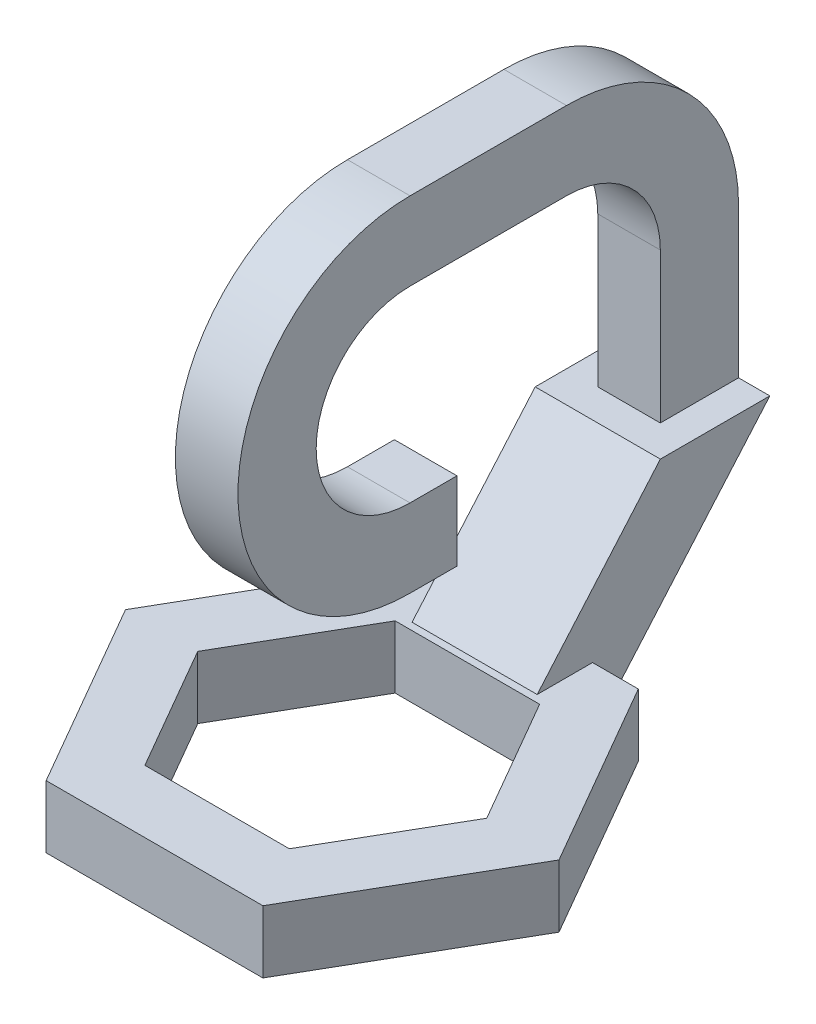
ISO-10303-21;
HEADER;
FILE_DESCRIPTION(('STEP AP214'),'2;1');
FILE_NAME('part.step','',(''),(''),'','','');
FILE_SCHEMA(('AUTOMOTIVE_DESIGN { 1 0 10303 214 1 1 1 1 }'));
ENDSEC;
DATA;
#1=APPLICATION_CONTEXT('core data for automotive mechanical design processes');
#2=APPLICATION_PROTOCOL_DEFINITION('international standard','automotive_design',2000,#1);
#3=PRODUCT_CONTEXT('',#1,'mechanical');
#4=PRODUCT('Part','Part','',(#3));
#5=PRODUCT_RELATED_PRODUCT_CATEGORY('part','',(#4));
#6=PRODUCT_DEFINITION_FORMATION('','',#4);
#7=PRODUCT_DEFINITION_CONTEXT('part definition',#1,'design');
#8=PRODUCT_DEFINITION('design','',#6,#7);
#9=PRODUCT_DEFINITION_SHAPE('','',#8);
#10=(LENGTH_UNIT() NAMED_UNIT(*) SI_UNIT(.MILLI.,.METRE.));
#11=(NAMED_UNIT(*) PLANE_ANGLE_UNIT() SI_UNIT($,.RADIAN.));
#12=(NAMED_UNIT(*) SI_UNIT($,.STERADIAN.) SOLID_ANGLE_UNIT());
#13=UNCERTAINTY_MEASURE_WITH_UNIT(LENGTH_MEASURE(1.E-05),#10,'distance_accuracy_value','');
#14=(GEOMETRIC_REPRESENTATION_CONTEXT(3) GLOBAL_UNCERTAINTY_ASSIGNED_CONTEXT((#13)) GLOBAL_UNIT_ASSIGNED_CONTEXT((#10,
#11,#12)) REPRESENTATION_CONTEXT('',''));
#15=CARTESIAN_POINT('',(0.,0.,0.));
#16=DIRECTION('',(0.,0.,1.));
#17=DIRECTION('',(1.,0.,0.));
#18=AXIS2_PLACEMENT_3D('',#15,#16,#17);
#19=CARTESIAN_POINT('',(80.,261.9,-466.675639388668));
#20=DIRECTION('',(0.,-1.,0.));
#21=DIRECTION('',(0.,0.,-1.));
#22=AXIS2_PLACEMENT_3D('',#19,#20,#21);
#23=PLANE('',#22);
#24=DIRECTION('',(0.,0.,-1.));
#25=VECTOR('',#24,1.);
#26=CARTESIAN_POINT('',(40.,261.9,-366.675639388668));
#27=LINE('',#26,#25);
#28=CARTESIAN_POINT('',(40.,261.9,-366.675639388668));
#29=VERTEX_POINT('',#28);
#30=CARTESIAN_POINT('',(40.,261.9,-466.675639388668));
#31=VERTEX_POINT('',#30);
#32=EDGE_CURVE('E419',#29,#31,#27,.T.);
#33=ORIENTED_EDGE('',*,*,#32,.F.);
#34=DIRECTION('',(-1.,0.,0.));
#35=VECTOR('',#34,1.);
#36=CARTESIAN_POINT('',(40.,261.9,-366.675639388668));
#37=LINE('',#36,#35);
#38=CARTESIAN_POINT('',(-40.,261.9,-366.675639388668));
#39=VERTEX_POINT('',#38);
#40=EDGE_CURVE('E415',#29,#39,#37,.T.);
#41=ORIENTED_EDGE('',*,*,#40,.T.);
#42=DIRECTION('',(0.,0.,-1.));
#43=VECTOR('',#42,1.);
#44=CARTESIAN_POINT('',(-40.,261.9,-366.675639388668));
#45=LINE('',#44,#43);
#46=CARTESIAN_POINT('',(-40.,261.9,-466.675639388668));
#47=VERTEX_POINT('',#46);
#48=EDGE_CURVE('E447',#39,#47,#45,.T.);
#49=ORIENTED_EDGE('',*,*,#48,.T.);
#50=DIRECTION('',(-1.,0.,0.));
#51=VECTOR('',#50,1.);
#52=CARTESIAN_POINT('',(80.,261.9,-466.675639388668));
#53=LINE('',#52,#51);
#54=CARTESIAN_POINT('',(-80.,261.9,-466.675639388668));
#55=VERTEX_POINT('',#54);
#56=EDGE_CURVE('E275',#47,#55,#53,.T.);
#57=ORIENTED_EDGE('',*,*,#56,.T.);
#58=DIRECTION('',(0.,0.,1.));
#59=VECTOR('',#58,1.);
#60=CARTESIAN_POINT('',(-80.,261.9,-466.675639388668));
#61=LINE('',#60,#59);
#62=CARTESIAN_POINT('',(-80.,261.9,-326.675639388668));
#63=VERTEX_POINT('',#62);
#64=EDGE_CURVE('E253',#55,#63,#61,.T.);
#65=ORIENTED_EDGE('',*,*,#64,.T.);
#66=DIRECTION('',(-1.,0.,0.));
#67=VECTOR('',#66,1.);
#68=CARTESIAN_POINT('',(80.,261.9,-326.675639388668));
#69=LINE('',#68,#67);
#70=CARTESIAN_POINT('',(80.,261.9,-326.675639388668));
#71=VERTEX_POINT('',#70);
#72=EDGE_CURVE('E272',#71,#63,#69,.T.);
#73=ORIENTED_EDGE('',*,*,#72,.F.);
#74=DIRECTION('',(0.,0.,1.));
#75=VECTOR('',#74,1.);
#76=CARTESIAN_POINT('',(80.,261.9,-466.675639388668));
#77=LINE('',#76,#75);
#78=CARTESIAN_POINT('',(80.,261.9,-466.675639388668));
#79=VERTEX_POINT('',#78);
#80=EDGE_CURVE('E261',#79,#71,#77,.T.);
#81=ORIENTED_EDGE('',*,*,#80,.F.);
#82=EDGE_CURVE('E276',#79,#31,#53,.T.);
#83=ORIENTED_EDGE('',*,*,#82,.T.);
#84=EDGE_LOOP('',(#33,#41,#49,#57,#65,#73,#81,#83));
#85=FACE_BOUND('',#84,.T.);
#86=ADVANCED_FACE('F35',(#85),#23,.F.);
#87=CARTESIAN_POINT('',(0.,80.,0.));
#88=DIRECTION('',(0.,1.,0.));
#89=DIRECTION('',(0.,0.,1.));
#90=AXIS2_PLACEMENT_3D('',#87,#88,#89);
#91=PLANE('',#90);
#92=DIRECTION('',(-0.5,0.,0.866025403784438));
#93=VECTOR('',#92,1.);
#94=CARTESIAN_POINT('',(-92.3619784648299,80.,-159.975639388668));
#95=LINE('',#94,#93);
#96=CARTESIAN_POINT('',(-92.3619784648299,80.,-159.975639388668));
#97=VERTEX_POINT('',#96);
#98=CARTESIAN_POINT('',(-184.72395692966,80.,0.));
#99=VERTEX_POINT('',#98);
#100=EDGE_CURVE('E288',#97,#99,#95,.T.);
#101=ORIENTED_EDGE('',*,*,#100,.F.);
#102=DIRECTION('',(-1.,0.,0.));
#103=VECTOR('',#102,1.);
#104=CARTESIAN_POINT('',(92.3619784648298,80.,-159.975639388668));
#105=LINE('',#104,#103);
#106=CARTESIAN_POINT('',(92.3619784648298,80.,-159.975639388668));
#107=VERTEX_POINT('',#106);
#108=EDGE_CURVE('E286',#107,#97,#105,.T.);
#109=ORIENTED_EDGE('',*,*,#108,.F.);
#110=DIRECTION('',(-0.5,0.,-0.866025403784438));
#111=VECTOR('',#110,1.);
#112=CARTESIAN_POINT('',(184.72395692966,80.,0.));
#113=LINE('',#112,#111);
#114=CARTESIAN_POINT('',(184.72395692966,80.,0.));
#115=VERTEX_POINT('',#114);
#116=EDGE_CURVE('E298',#115,#107,#113,.T.);
#117=ORIENTED_EDGE('',*,*,#116,.F.);
#118=DIRECTION('',(0.5,0.,-0.866025403784439));
#119=VECTOR('',#118,1.);
#120=CARTESIAN_POINT('',(92.3619784648299,80.,159.975639388668));
#121=LINE('',#120,#119);
#122=CARTESIAN_POINT('',(92.3619784648299,80.,159.975639388668));
#123=VERTEX_POINT('',#122);
#124=EDGE_CURVE('E295',#123,#115,#121,.T.);
#125=ORIENTED_EDGE('',*,*,#124,.F.);
#126=DIRECTION('',(1.,0.,0.));
#127=VECTOR('',#126,1.);
#128=CARTESIAN_POINT('',(-92.36197846483,80.,159.975639388668));
#129=LINE('',#128,#127);
#130=CARTESIAN_POINT('',(-92.36197846483,80.,159.975639388668));
#131=VERTEX_POINT('',#130);
#132=EDGE_CURVE('E293',#131,#123,#129,.T.);
#133=ORIENTED_EDGE('',*,*,#132,.F.);
#134=DIRECTION('',(0.5,0.,0.866025403784439));
#135=VECTOR('',#134,1.);
#136=CARTESIAN_POINT('',(-184.72395692966,80.,0.));
#137=LINE('',#136,#135);
#138=EDGE_CURVE('E291',#99,#131,#137,.T.);
#139=ORIENTED_EDGE('',*,*,#138,.F.);
#140=EDGE_LOOP('',(#101,#109,#117,#125,#133,#139));
#141=FACE_BOUND('',#140,.T.);
#142=DIRECTION('',(-1.,0.,0.));
#143=VECTOR('',#142,1.);
#144=CARTESIAN_POINT('',(138.55,80.,-239.975639388668));
#145=LINE('',#144,#143);
#146=CARTESIAN_POINT('',(138.55,80.,-239.975639388668));
#147=VERTEX_POINT('',#146);
#148=CARTESIAN_POINT('',(80.,80.,-239.975639388668));
#149=VERTEX_POINT('',#148);
#150=EDGE_CURVE('E331',#147,#149,#145,.T.);
#151=ORIENTED_EDGE('',*,*,#150,.T.);
#152=DIRECTION('',(0.,0.,1.));
#153=VECTOR('',#152,1.);
#154=CARTESIAN_POINT('',(80.,80.,0.));
#155=LINE('',#154,#153);
#156=CARTESIAN_POINT('',(80.,80.,-169.223443894204));
#157=VERTEX_POINT('',#156);
#158=EDGE_CURVE('E282',#149,#157,#155,.T.);
#159=ORIENTED_EDGE('',*,*,#158,.T.);
#160=DIRECTION('',(-1.,0.,0.));
#161=VECTOR('',#160,1.);
#162=CARTESIAN_POINT('',(80.,80.,-169.223443894204));
#163=LINE('',#162,#161);
#164=CARTESIAN_POINT('',(-80.,80.,-169.223443894204));
#165=VERTEX_POINT('',#164);
#166=EDGE_CURVE('E265',#157,#165,#163,.T.);
#167=ORIENTED_EDGE('',*,*,#166,.T.);
#168=DIRECTION('',(0.,0.,1.));
#169=VECTOR('',#168,1.);
#170=CARTESIAN_POINT('',(-80.,80.,0.));
#171=LINE('',#170,#169);
#172=CARTESIAN_POINT('',(-80.,80.,-239.975639388668));
#173=VERTEX_POINT('',#172);
#174=EDGE_CURVE('E280',#173,#165,#171,.T.);
#175=ORIENTED_EDGE('',*,*,#174,.F.);
#176=CARTESIAN_POINT('',(-138.55,80.,-239.975639388668));
#177=VERTEX_POINT('',#176);
#178=EDGE_CURVE('E335',#173,#177,#145,.T.);
#179=ORIENTED_EDGE('',*,*,#178,.T.);
#180=DIRECTION('',(-0.5,0.,0.866025403784438));
#181=VECTOR('',#180,1.);
#182=CARTESIAN_POINT('',(-138.55,80.,-239.975639388668));
#183=LINE('',#182,#181);
#184=CARTESIAN_POINT('',(-277.1,80.,0.));
#185=VERTEX_POINT('',#184);
#186=EDGE_CURVE('E334',#177,#185,#183,.T.);
#187=ORIENTED_EDGE('',*,*,#186,.T.);
#188=DIRECTION('',(0.5,0.,0.866025403784439));
#189=VECTOR('',#188,1.);
#190=CARTESIAN_POINT('',(-277.1,80.,0.));
#191=LINE('',#190,#189);
#192=CARTESIAN_POINT('',(-138.55,80.,239.975639388668));
#193=VERTEX_POINT('',#192);
#194=EDGE_CURVE('E337',#185,#193,#191,.T.);
#195=ORIENTED_EDGE('',*,*,#194,.T.);
#196=DIRECTION('',(1.,0.,0.));
#197=VECTOR('',#196,1.);
#198=CARTESIAN_POINT('',(-138.55,80.,239.975639388668));
#199=LINE('',#198,#197);
#200=CARTESIAN_POINT('',(138.55,80.,239.975639388668));
#201=VERTEX_POINT('',#200);
#202=EDGE_CURVE('E339',#193,#201,#199,.T.);
#203=ORIENTED_EDGE('',*,*,#202,.T.);
#204=DIRECTION('',(0.5,0.,-0.866025403784439));
#205=VECTOR('',#204,1.);
#206=CARTESIAN_POINT('',(138.55,80.,239.975639388668));
#207=LINE('',#206,#205);
#208=CARTESIAN_POINT('',(277.1,80.,0.));
#209=VERTEX_POINT('',#208);
#210=EDGE_CURVE('E341',#201,#209,#207,.T.);
#211=ORIENTED_EDGE('',*,*,#210,.T.);
#212=DIRECTION('',(-0.5,0.,-0.866025403784438));
#213=VECTOR('',#212,1.);
#214=CARTESIAN_POINT('',(277.1,80.,0.));
#215=LINE('',#214,#213);
#216=EDGE_CURVE('E343',#209,#147,#215,.T.);
#217=ORIENTED_EDGE('',*,*,#216,.T.);
#218=EDGE_LOOP('',(#151,#159,#167,#175,#179,#187,#195,#203,#211,#217));
#219=FACE_BOUND('',#218,.T.);
#220=ADVANCED_FACE('F395',(#141,#219),#91,.T.);
#221=CARTESIAN_POINT('',(138.55,80.,-239.975639388668));
#222=DIRECTION('',(0.,0.,1.));
#223=DIRECTION('',(1.,0.,0.));
#224=AXIS2_PLACEMENT_3D('',#221,#222,#223);
#225=PLANE('',#224);
#226=DIRECTION('',(0.,-1.,0.));
#227=VECTOR('',#226,1.);
#228=CARTESIAN_POINT('',(80.,80.,-239.975639388668));
#229=LINE('',#228,#227);
#230=CARTESIAN_POINT('',(80.,0.,-239.975639388668));
#231=VERTEX_POINT('',#230);
#232=EDGE_CURVE('E11',#149,#231,#229,.T.);
#233=ORIENTED_EDGE('',*,*,#232,.F.);
#234=ORIENTED_EDGE('',*,*,#150,.F.);
#235=DIRECTION('',(0.,-1.,0.));
#236=VECTOR('',#235,1.);
#237=CARTESIAN_POINT('',(138.55,80.,-239.975639388668));
#238=LINE('',#237,#236);
#239=CARTESIAN_POINT('',(138.55,0.,-239.975639388668));
#240=VERTEX_POINT('',#239);
#241=EDGE_CURVE('E345',#147,#240,#238,.T.);
#242=ORIENTED_EDGE('',*,*,#241,.T.);
#243=DIRECTION('',(-1.,0.,0.));
#244=VECTOR('',#243,1.);
#245=CARTESIAN_POINT('',(138.55,0.,-239.975639388668));
#246=LINE('',#245,#244);
#247=EDGE_CURVE('E346',#240,#231,#246,.T.);
#248=ORIENTED_EDGE('',*,*,#247,.T.);
#249=EDGE_LOOP('',(#233,#234,#242,#248));
#250=FACE_BOUND('',#249,.T.);
#251=ADVANCED_FACE('F531',(#250),#225,.F.);
#252=CARTESIAN_POINT('',(0.,0.,0.));
#253=DIRECTION('',(0.,1.,0.));
#254=DIRECTION('',(0.,0.,1.));
#255=AXIS2_PLACEMENT_3D('',#252,#253,#254);
#256=PLANE('',#255);
#257=DIRECTION('',(-1.,0.,0.));
#258=VECTOR('',#257,1.);
#259=CARTESIAN_POINT('',(80.,0.,-239.975639388668));
#260=LINE('',#259,#258);
#261=CARTESIAN_POINT('',(-80.,0.,-239.975639388668));
#262=VERTEX_POINT('',#261);
#263=EDGE_CURVE('E58',#231,#262,#260,.T.);
#264=ORIENTED_EDGE('',*,*,#263,.F.);
#265=ORIENTED_EDGE('',*,*,#247,.F.);
#266=DIRECTION('',(-0.5,0.,-0.866025403784438));
#267=VECTOR('',#266,1.);
#268=CARTESIAN_POINT('',(277.1,0.,0.));
#269=LINE('',#268,#267);
#270=CARTESIAN_POINT('',(277.1,0.,0.));
#271=VERTEX_POINT('',#270);
#272=EDGE_CURVE('E357',#271,#240,#269,.T.);
#273=ORIENTED_EDGE('',*,*,#272,.F.);
#274=DIRECTION('',(0.5,0.,-0.866025403784439));
#275=VECTOR('',#274,1.);
#276=CARTESIAN_POINT('',(138.55,0.,239.975639388668));
#277=LINE('',#276,#275);
#278=CARTESIAN_POINT('',(138.55,0.,239.975639388668));
#279=VERTEX_POINT('',#278);
#280=EDGE_CURVE('E355',#279,#271,#277,.T.);
#281=ORIENTED_EDGE('',*,*,#280,.F.);
#282=DIRECTION('',(1.,0.,0.));
#283=VECTOR('',#282,1.);
#284=CARTESIAN_POINT('',(-138.55,0.,239.975639388668));
#285=LINE('',#284,#283);
#286=CARTESIAN_POINT('',(-138.55,0.,239.975639388668));
#287=VERTEX_POINT('',#286);
#288=EDGE_CURVE('E353',#287,#279,#285,.T.);
#289=ORIENTED_EDGE('',*,*,#288,.F.);
#290=DIRECTION('',(0.5,0.,0.866025403784439));
#291=VECTOR('',#290,1.);
#292=CARTESIAN_POINT('',(-277.1,0.,0.));
#293=LINE('',#292,#291);
#294=CARTESIAN_POINT('',(-277.1,0.,0.));
#295=VERTEX_POINT('',#294);
#296=EDGE_CURVE('E351',#295,#287,#293,.T.);
#297=ORIENTED_EDGE('',*,*,#296,.F.);
#298=DIRECTION('',(-0.5,0.,0.866025403784438));
#299=VECTOR('',#298,1.);
#300=CARTESIAN_POINT('',(-138.55,0.,-239.975639388668));
#301=LINE('',#300,#299);
#302=CARTESIAN_POINT('',(-138.55,0.,-239.975639388668));
#303=VERTEX_POINT('',#302);
#304=EDGE_CURVE('E349',#303,#295,#301,.T.);
#305=ORIENTED_EDGE('',*,*,#304,.F.);
#306=EDGE_CURVE('E330',#262,#303,#246,.T.);
#307=ORIENTED_EDGE('',*,*,#306,.F.);
#308=EDGE_LOOP('',(#264,#265,#273,#281,#289,#297,#305,#307));
#309=FACE_BOUND('',#308,.T.);
#310=DIRECTION('',(-1.,0.,0.));
#311=VECTOR('',#310,1.);
#312=CARTESIAN_POINT('',(92.3619784648298,0.,-159.975639388668));
#313=LINE('',#312,#311);
#314=CARTESIAN_POINT('',(92.3619784648298,0.,-159.975639388668));
#315=VERTEX_POINT('',#314);
#316=CARTESIAN_POINT('',(-92.3619784648299,0.,-159.975639388668));
#317=VERTEX_POINT('',#316);
#318=EDGE_CURVE('E285',#315,#317,#313,.T.);
#319=ORIENTED_EDGE('',*,*,#318,.T.);
#320=DIRECTION('',(-0.5,0.,0.866025403784438));
#321=VECTOR('',#320,1.);
#322=CARTESIAN_POINT('',(-92.3619784648299,0.,-159.975639388668));
#323=LINE('',#322,#321);
#324=CARTESIAN_POINT('',(-184.72395692966,0.,0.));
#325=VERTEX_POINT('',#324);
#326=EDGE_CURVE('E303',#317,#325,#323,.T.);
#327=ORIENTED_EDGE('',*,*,#326,.T.);
#328=DIRECTION('',(0.5,0.,0.866025403784439));
#329=VECTOR('',#328,1.);
#330=CARTESIAN_POINT('',(-184.72395692966,0.,0.));
#331=LINE('',#330,#329);
#332=CARTESIAN_POINT('',(-92.36197846483,0.,159.975639388668));
#333=VERTEX_POINT('',#332);
#334=EDGE_CURVE('E306',#325,#333,#331,.T.);
#335=ORIENTED_EDGE('',*,*,#334,.T.);
#336=DIRECTION('',(1.,0.,0.));
#337=VECTOR('',#336,1.);
#338=CARTESIAN_POINT('',(-92.36197846483,0.,159.975639388668));
#339=LINE('',#338,#337);
#340=CARTESIAN_POINT('',(92.3619784648299,0.,159.975639388668));
#341=VERTEX_POINT('',#340);
#342=EDGE_CURVE('E309',#333,#341,#339,.T.);
#343=ORIENTED_EDGE('',*,*,#342,.T.);
#344=DIRECTION('',(0.5,0.,-0.866025403784439));
#345=VECTOR('',#344,1.);
#346=CARTESIAN_POINT('',(92.3619784648299,0.,159.975639388668));
#347=LINE('',#346,#345);
#348=CARTESIAN_POINT('',(184.72395692966,0.,0.));
#349=VERTEX_POINT('',#348);
#350=EDGE_CURVE('E312',#341,#349,#347,.T.);
#351=ORIENTED_EDGE('',*,*,#350,.T.);
#352=DIRECTION('',(-0.5,0.,-0.866025403784438));
#353=VECTOR('',#352,1.);
#354=CARTESIAN_POINT('',(184.72395692966,0.,0.));
#355=LINE('',#354,#353);
#356=EDGE_CURVE('E289',#349,#315,#355,.T.);
#357=ORIENTED_EDGE('',*,*,#356,.T.);
#358=EDGE_LOOP('',(#319,#327,#335,#343,#351,#357));
#359=FACE_BOUND('',#358,.T.);
#360=ADVANCED_FACE('F384',(#309,#359),#256,.F.);
#361=ORIENTED_EDGE('',*,*,#178,.F.);
#362=DIRECTION('',(0.,-1.,0.));
#363=VECTOR('',#362,1.);
#364=CARTESIAN_POINT('',(-80.,80.,-239.975639388668));
#365=LINE('',#364,#363);
#366=EDGE_CURVE('E43',#173,#262,#365,.T.);
#367=ORIENTED_EDGE('',*,*,#366,.T.);
#368=ORIENTED_EDGE('',*,*,#306,.T.);
#369=DIRECTION('',(0.,-1.,0.));
#370=VECTOR('',#369,1.);
#371=CARTESIAN_POINT('',(-138.55,80.,-239.975639388668));
#372=LINE('',#371,#370);
#373=EDGE_CURVE('E373',#177,#303,#372,.T.);
#374=ORIENTED_EDGE('',*,*,#373,.F.);
#375=EDGE_LOOP('',(#361,#367,#368,#374));
#376=FACE_BOUND('',#375,.T.);
#377=ADVANCED_FACE('F37',(#376),#225,.F.);
#378=CARTESIAN_POINT('',(-138.55,80.,-239.975639388668));
#379=DIRECTION('',(0.866025403784438,0.,0.5));
#380=DIRECTION('',(0.5,0.,-0.866025403784438));
#381=AXIS2_PLACEMENT_3D('',#378,#379,#380);
#382=PLANE('',#381);
#383=ORIENTED_EDGE('',*,*,#304,.T.);
#384=DIRECTION('',(0.,-1.,0.));
#385=VECTOR('',#384,1.);
#386=CARTESIAN_POINT('',(-277.1,80.,0.));
#387=LINE('',#386,#385);
#388=EDGE_CURVE('E370',#185,#295,#387,.T.);
#389=ORIENTED_EDGE('',*,*,#388,.F.);
#390=ORIENTED_EDGE('',*,*,#186,.F.);
#391=ORIENTED_EDGE('',*,*,#373,.T.);
#392=EDGE_LOOP('',(#383,#389,#390,#391));
#393=FACE_BOUND('',#392,.T.);
#394=ADVANCED_FACE('F392',(#393),#382,.F.);
#395=CARTESIAN_POINT('',(-277.1,80.,0.));
#396=DIRECTION('',(0.866025403784439,0.,-0.5));
#397=DIRECTION('',(-0.5,0.,-0.866025403784439));
#398=AXIS2_PLACEMENT_3D('',#395,#396,#397);
#399=PLANE('',#398);
#400=ORIENTED_EDGE('',*,*,#296,.T.);
#401=DIRECTION('',(0.,-1.,0.));
#402=VECTOR('',#401,1.);
#403=CARTESIAN_POINT('',(-138.55,80.,239.975639388668));
#404=LINE('',#403,#402);
#405=EDGE_CURVE('E367',#193,#287,#404,.T.);
#406=ORIENTED_EDGE('',*,*,#405,.F.);
#407=ORIENTED_EDGE('',*,*,#194,.F.);
#408=ORIENTED_EDGE('',*,*,#388,.T.);
#409=EDGE_LOOP('',(#400,#406,#407,#408));
#410=FACE_BOUND('',#409,.T.);
#411=ADVANCED_FACE('F576',(#410),#399,.F.);
#412=CARTESIAN_POINT('',(-138.55,80.,239.975639388668));
#413=DIRECTION('',(0.,0.,-1.));
#414=DIRECTION('',(-1.,0.,0.));
#415=AXIS2_PLACEMENT_3D('',#412,#413,#414);
#416=PLANE('',#415);
#417=ORIENTED_EDGE('',*,*,#288,.T.);
#418=DIRECTION('',(0.,-1.,0.));
#419=VECTOR('',#418,1.);
#420=CARTESIAN_POINT('',(138.55,80.,239.975639388668));
#421=LINE('',#420,#419);
#422=EDGE_CURVE('E364',#201,#279,#421,.T.);
#423=ORIENTED_EDGE('',*,*,#422,.F.);
#424=ORIENTED_EDGE('',*,*,#202,.F.);
#425=ORIENTED_EDGE('',*,*,#405,.T.);
#426=EDGE_LOOP('',(#417,#423,#424,#425));
#427=FACE_BOUND('',#426,.T.);
#428=ADVANCED_FACE('F572',(#427),#416,.F.);
#429=CARTESIAN_POINT('',(138.55,80.,239.975639388668));
#430=DIRECTION('',(-0.866025403784439,0.,-0.5));
#431=DIRECTION('',(-0.5,0.,0.866025403784439));
#432=AXIS2_PLACEMENT_3D('',#429,#430,#431);
#433=PLANE('',#432);
#434=ORIENTED_EDGE('',*,*,#280,.T.);
#435=DIRECTION('',(0.,-1.,0.));
#436=VECTOR('',#435,1.);
#437=CARTESIAN_POINT('',(277.1,80.,0.));
#438=LINE('',#437,#436);
#439=EDGE_CURVE('E361',#209,#271,#438,.T.);
#440=ORIENTED_EDGE('',*,*,#439,.F.);
#441=ORIENTED_EDGE('',*,*,#210,.F.);
#442=ORIENTED_EDGE('',*,*,#422,.T.);
#443=EDGE_LOOP('',(#434,#440,#441,#442));
#444=FACE_BOUND('',#443,.T.);
#445=ADVANCED_FACE('F568',(#444),#433,.F.);
#446=CARTESIAN_POINT('',(277.1,80.,0.));
#447=DIRECTION('',(-0.866025403784438,0.,0.5));
#448=DIRECTION('',(0.5,0.,0.866025403784438));
#449=AXIS2_PLACEMENT_3D('',#446,#447,#448);
#450=PLANE('',#449);
#451=ORIENTED_EDGE('',*,*,#272,.T.);
#452=ORIENTED_EDGE('',*,*,#241,.F.);
#453=ORIENTED_EDGE('',*,*,#216,.F.);
#454=ORIENTED_EDGE('',*,*,#439,.T.);
#455=EDGE_LOOP('',(#451,#452,#453,#454));
#456=FACE_BOUND('',#455,.T.);
#457=ADVANCED_FACE('F561',(#456),#450,.F.);
#458=CARTESIAN_POINT('',(92.3619784648298,80.,-159.975639388668));
#459=DIRECTION('',(0.,0.,1.));
#460=DIRECTION('',(1.,0.,0.));
#461=AXIS2_PLACEMENT_3D('',#458,#459,#460);
#462=PLANE('',#461);
#463=ORIENTED_EDGE('',*,*,#318,.F.);
#464=DIRECTION('',(0.,-1.,0.));
#465=VECTOR('',#464,1.);
#466=CARTESIAN_POINT('',(92.3619784648298,80.,-159.975639388668));
#467=LINE('',#466,#465);
#468=EDGE_CURVE('E300',#107,#315,#467,.T.);
#469=ORIENTED_EDGE('',*,*,#468,.F.);
#470=ORIENTED_EDGE('',*,*,#108,.T.);
#471=DIRECTION('',(0.,-1.,0.));
#472=VECTOR('',#471,1.);
#473=CARTESIAN_POINT('',(-92.3619784648299,80.,-159.975639388668));
#474=LINE('',#473,#472);
#475=EDGE_CURVE('E327',#97,#317,#474,.T.);
#476=ORIENTED_EDGE('',*,*,#475,.T.);
#477=EDGE_LOOP('',(#463,#469,#470,#476));
#478=FACE_BOUND('',#477,.T.);
#479=ADVANCED_FACE('F558',(#478),#462,.T.);
#480=CARTESIAN_POINT('',(-92.3619784648299,80.,-159.975639388668));
#481=DIRECTION('',(0.866025403784438,0.,0.5));
#482=DIRECTION('',(0.5,0.,-0.866025403784438));
#483=AXIS2_PLACEMENT_3D('',#480,#481,#482);
#484=PLANE('',#483);
#485=ORIENTED_EDGE('',*,*,#326,.F.);
#486=ORIENTED_EDGE('',*,*,#475,.F.);
#487=ORIENTED_EDGE('',*,*,#100,.T.);
#488=DIRECTION('',(0.,-1.,0.));
#489=VECTOR('',#488,1.);
#490=CARTESIAN_POINT('',(-184.72395692966,80.,0.));
#491=LINE('',#490,#489);
#492=EDGE_CURVE('E325',#99,#325,#491,.T.);
#493=ORIENTED_EDGE('',*,*,#492,.T.);
#494=EDGE_LOOP('',(#485,#486,#487,#493));
#495=FACE_BOUND('',#494,.T.);
#496=ADVANCED_FACE('F554',(#495),#484,.T.);
#497=CARTESIAN_POINT('',(-184.72395692966,80.,0.));
#498=DIRECTION('',(0.866025403784439,0.,-0.5));
#499=DIRECTION('',(-0.5,0.,-0.866025403784439));
#500=AXIS2_PLACEMENT_3D('',#497,#498,#499);
#501=PLANE('',#500);
#502=ORIENTED_EDGE('',*,*,#334,.F.);
#503=ORIENTED_EDGE('',*,*,#492,.F.);
#504=ORIENTED_EDGE('',*,*,#138,.T.);
#505=DIRECTION('',(0.,-1.,0.));
#506=VECTOR('',#505,1.);
#507=CARTESIAN_POINT('',(-92.36197846483,80.,159.975639388668));
#508=LINE('',#507,#506);
#509=EDGE_CURVE('E323',#131,#333,#508,.T.);
#510=ORIENTED_EDGE('',*,*,#509,.T.);
#511=EDGE_LOOP('',(#502,#503,#504,#510));
#512=FACE_BOUND('',#511,.T.);
#513=ADVANCED_FACE('F550',(#512),#501,.T.);
#514=CARTESIAN_POINT('',(-92.36197846483,80.,159.975639388668));
#515=DIRECTION('',(0.,0.,-1.));
#516=DIRECTION('',(-1.,0.,0.));
#517=AXIS2_PLACEMENT_3D('',#514,#515,#516);
#518=PLANE('',#517);
#519=ORIENTED_EDGE('',*,*,#342,.F.);
#520=ORIENTED_EDGE('',*,*,#509,.F.);
#521=ORIENTED_EDGE('',*,*,#132,.T.);
#522=DIRECTION('',(0.,-1.,0.));
#523=VECTOR('',#522,1.);
#524=CARTESIAN_POINT('',(92.3619784648299,80.,159.975639388668));
#525=LINE('',#524,#523);
#526=EDGE_CURVE('E321',#123,#341,#525,.T.);
#527=ORIENTED_EDGE('',*,*,#526,.T.);
#528=EDGE_LOOP('',(#519,#520,#521,#527));
#529=FACE_BOUND('',#528,.T.);
#530=ADVANCED_FACE('F546',(#529),#518,.T.);
#531=CARTESIAN_POINT('',(92.3619784648299,80.,159.975639388668));
#532=DIRECTION('',(-0.866025403784439,0.,-0.5));
#533=DIRECTION('',(-0.5,0.,0.866025403784439));
#534=AXIS2_PLACEMENT_3D('',#531,#532,#533);
#535=PLANE('',#534);
#536=ORIENTED_EDGE('',*,*,#350,.F.);
#537=ORIENTED_EDGE('',*,*,#526,.F.);
#538=ORIENTED_EDGE('',*,*,#124,.T.);
#539=DIRECTION('',(0.,-1.,0.));
#540=VECTOR('',#539,1.);
#541=CARTESIAN_POINT('',(184.72395692966,80.,0.));
#542=LINE('',#541,#540);
#543=EDGE_CURVE('E319',#115,#349,#542,.T.);
#544=ORIENTED_EDGE('',*,*,#543,.T.);
#545=EDGE_LOOP('',(#536,#537,#538,#544));
#546=FACE_BOUND('',#545,.T.);
#547=ADVANCED_FACE('F542',(#546),#535,.T.);
#548=CARTESIAN_POINT('',(184.72395692966,80.,0.));
#549=DIRECTION('',(-0.866025403784438,0.,0.5));
#550=DIRECTION('',(0.5,0.,0.866025403784438));
#551=AXIS2_PLACEMENT_3D('',#548,#549,#550);
#552=PLANE('',#551);
#553=ORIENTED_EDGE('',*,*,#356,.F.);
#554=ORIENTED_EDGE('',*,*,#543,.F.);
#555=ORIENTED_EDGE('',*,*,#116,.T.);
#556=ORIENTED_EDGE('',*,*,#468,.T.);
#557=EDGE_LOOP('',(#553,#554,#555,#556));
#558=FACE_BOUND('',#557,.T.);
#559=ADVANCED_FACE('F539',(#558),#552,.T.);
#560=CARTESIAN_POINT('',(80.,0.,-239.975639388668));
#561=DIRECTION('',(0.,0.654468799268045,0.756089009829295));
#562=DIRECTION('',(0.,-0.756089009829295,0.654468799268045));
#563=AXIS2_PLACEMENT_3D('',#560,#561,#562);
#564=PLANE('',#563);
#565=DIRECTION('',(0.,0.756089009829295,-0.654468799268045));
#566=VECTOR('',#565,1.);
#567=CARTESIAN_POINT('',(-80.,0.,-239.975639388668));
#568=LINE('',#567,#566);
#569=EDGE_CURVE('E251',#262,#55,#568,.T.);
#570=ORIENTED_EDGE('',*,*,#569,.T.);
#571=ORIENTED_EDGE('',*,*,#56,.F.);
#572=DIRECTION('',(-1.,0.,0.));
#573=VECTOR('',#572,1.);
#574=CARTESIAN_POINT('',(40.,261.9,-466.675639388668));
#575=LINE('',#574,#573);
#576=EDGE_CURVE('E413',#31,#47,#575,.T.);
#577=ORIENTED_EDGE('',*,*,#576,.F.);
#578=ORIENTED_EDGE('',*,*,#82,.F.);
#579=DIRECTION('',(0.,0.756089009829295,-0.654468799268045));
#580=VECTOR('',#579,1.);
#581=CARTESIAN_POINT('',(80.,0.,-239.975639388668));
#582=LINE('',#581,#580);
#583=EDGE_CURVE('E259',#231,#79,#582,.T.);
#584=ORIENTED_EDGE('',*,*,#583,.F.);
#585=ORIENTED_EDGE('',*,*,#263,.T.);
#586=EDGE_LOOP('',(#570,#571,#577,#578,#584,#585));
#587=FACE_BOUND('',#586,.T.);
#588=ADVANCED_FACE('F410',(#587),#564,.F.);
#589=CARTESIAN_POINT('',(80.,261.9,-326.675639388668));
#590=DIRECTION('',(0.,-0.654468799268045,-0.756089009829295));
#591=DIRECTION('',(0.,0.756089009829295,-0.654468799268045));
#592=AXIS2_PLACEMENT_3D('',#589,#590,#591);
#593=PLANE('',#592);
#594=DIRECTION('',(0.,-0.756089009829295,0.654468799268045));
#595=VECTOR('',#594,1.);
#596=CARTESIAN_POINT('',(-80.,261.9,-326.675639388668));
#597=LINE('',#596,#595);
#598=EDGE_CURVE('E262',#63,#165,#597,.T.);
#599=ORIENTED_EDGE('',*,*,#598,.T.);
#600=ORIENTED_EDGE('',*,*,#166,.F.);
#601=DIRECTION('',(0.,-0.756089009829295,0.654468799268045));
#602=VECTOR('',#601,1.);
#603=CARTESIAN_POINT('',(80.,261.9,-326.675639388668));
#604=LINE('',#603,#602);
#605=EDGE_CURVE('E264',#71,#157,#604,.T.);
#606=ORIENTED_EDGE('',*,*,#605,.F.);
#607=ORIENTED_EDGE('',*,*,#72,.T.);
#608=EDGE_LOOP('',(#599,#600,#606,#607));
#609=FACE_BOUND('',#608,.T.);
#610=ADVANCED_FACE('F402',(#609),#593,.F.);
#611=CARTESIAN_POINT('',(80.,0.,0.));
#612=DIRECTION('',(-1.,0.,0.));
#613=DIRECTION('',(0.,0.,1.));
#614=AXIS2_PLACEMENT_3D('',#611,#612,#613);
#615=PLANE('',#614);
#616=ORIENTED_EDGE('',*,*,#158,.F.);
#617=ORIENTED_EDGE('',*,*,#232,.T.);
#618=ORIENTED_EDGE('',*,*,#583,.T.);
#619=ORIENTED_EDGE('',*,*,#80,.T.);
#620=ORIENTED_EDGE('',*,*,#605,.T.);
#621=EDGE_LOOP('',(#616,#617,#618,#619,#620));
#622=FACE_BOUND('',#621,.T.);
#623=ADVANCED_FACE('F601',(#622),#615,.F.);
#624=CARTESIAN_POINT('',(-80.,0.,0.));
#625=DIRECTION('',(-1.,0.,0.));
#626=DIRECTION('',(0.,0.,1.));
#627=AXIS2_PLACEMENT_3D('',#624,#625,#626);
#628=PLANE('',#627);
#629=ORIENTED_EDGE('',*,*,#366,.F.);
#630=ORIENTED_EDGE('',*,*,#174,.T.);
#631=ORIENTED_EDGE('',*,*,#598,.F.);
#632=ORIENTED_EDGE('',*,*,#64,.F.);
#633=ORIENTED_EDGE('',*,*,#569,.F.);
#634=EDGE_LOOP('',(#629,#630,#631,#632,#633));
#635=FACE_BOUND('',#634,.T.);
#636=ADVANCED_FACE('F399',(#635),#628,.T.);
#637=CARTESIAN_POINT('',(40.,453.4,-246.675639388668));
#638=DIRECTION('',(-1.,0.,0.));
#639=DIRECTION('',(0.,0.,1.));
#640=AXIS2_PLACEMENT_3D('',#637,#638,#639);
#641=CYLINDRICAL_SURFACE('',#640,220.);
#642=CARTESIAN_POINT('',(-40.,453.4,-246.675639388668));
#643=DIRECTION('',(1.,0.,0.));
#644=DIRECTION('',(0.,0.,1.));
#645=AXIS2_PLACEMENT_3D('',#642,#643,#644);
#646=CIRCLE('',#645,220.);
#647=CARTESIAN_POINT('',(-40.,453.4,-466.675639388668));
#648=VERTEX_POINT('',#647);
#649=CARTESIAN_POINT('',(-40.,673.4,-246.675639388668));
#650=VERTEX_POINT('',#649);
#651=EDGE_CURVE('E250',#648,#650,#646,.T.);
#652=ORIENTED_EDGE('',*,*,#651,.T.);
#653=DIRECTION('',(-1.,0.,0.));
#654=VECTOR('',#653,1.);
#655=CARTESIAN_POINT('',(40.,673.4,-246.675639388668));
#656=LINE('',#655,#654);
#657=CARTESIAN_POINT('',(40.,673.4,-246.675639388668));
#658=VERTEX_POINT('',#657);
#659=EDGE_CURVE('E232',#658,#650,#656,.T.);
#660=ORIENTED_EDGE('',*,*,#659,.F.);
#661=CARTESIAN_POINT('',(40.,453.4,-246.675639388668));
#662=DIRECTION('',(1.,0.,0.));
#663=DIRECTION('',(0.,0.,1.));
#664=AXIS2_PLACEMENT_3D('',#661,#662,#663);
#665=CIRCLE('',#664,220.);
#666=CARTESIAN_POINT('',(40.,453.4,-466.675639388668));
#667=VERTEX_POINT('',#666);
#668=EDGE_CURVE('E239',#667,#658,#665,.T.);
#669=ORIENTED_EDGE('',*,*,#668,.F.);
#670=DIRECTION('',(-1.,0.,0.));
#671=VECTOR('',#670,1.);
#672=CARTESIAN_POINT('',(40.,453.4,-466.675639388668));
#673=LINE('',#672,#671);
#674=EDGE_CURVE('E416',#667,#648,#673,.T.);
#675=ORIENTED_EDGE('',*,*,#674,.T.);
#676=EDGE_LOOP('',(#652,#660,#669,#675));
#677=FACE_BOUND('',#676,.T.);
#678=ADVANCED_FACE('F249',(#677),#641,.T.);
#679=CARTESIAN_POINT('',(40.,673.4,-246.675639388668));
#680=DIRECTION('',(0.,-1.,0.));
#681=DIRECTION('',(0.,0.,-1.));
#682=AXIS2_PLACEMENT_3D('',#679,#680,#681);
#683=PLANE('',#682);
#684=DIRECTION('',(0.,0.,1.));
#685=VECTOR('',#684,1.);
#686=CARTESIAN_POINT('',(-40.,673.4,-246.675639388668));
#687=LINE('',#686,#685);
#688=CARTESIAN_POINT('',(-40.,673.4,-46.6756393886679));
#689=VERTEX_POINT('',#688);
#690=EDGE_CURVE('E429',#650,#689,#687,.T.);
#691=ORIENTED_EDGE('',*,*,#690,.T.);
#692=DIRECTION('',(-1.,0.,0.));
#693=VECTOR('',#692,1.);
#694=CARTESIAN_POINT('',(40.,673.4,-46.6756393886679));
#695=LINE('',#694,#693);
#696=CARTESIAN_POINT('',(40.,673.4,-46.6756393886679));
#697=VERTEX_POINT('',#696);
#698=EDGE_CURVE('E235',#697,#689,#695,.T.);
#699=ORIENTED_EDGE('',*,*,#698,.F.);
#700=DIRECTION('',(0.,0.,1.));
#701=VECTOR('',#700,1.);
#702=CARTESIAN_POINT('',(40.,673.4,-246.675639388668));
#703=LINE('',#702,#701);
#704=EDGE_CURVE('E228',#658,#697,#703,.T.);
#705=ORIENTED_EDGE('',*,*,#704,.F.);
#706=ORIENTED_EDGE('',*,*,#659,.T.);
#707=EDGE_LOOP('',(#691,#699,#705,#706));
#708=FACE_BOUND('',#707,.T.);
#709=ADVANCED_FACE('F230',(#708),#683,.F.);
#710=CARTESIAN_POINT('',(40.,453.4,-46.6756393886678));
#711=DIRECTION('',(-1.,0.,0.));
#712=DIRECTION('',(0.,0.,1.));
#713=AXIS2_PLACEMENT_3D('',#710,#711,#712);
#714=CYLINDRICAL_SURFACE('',#713,220.);
#715=CARTESIAN_POINT('',(-40.,453.4,-46.6756393886678));
#716=DIRECTION('',(1.,0.,0.));
#717=DIRECTION('',(0.,0.,-1.));
#718=AXIS2_PLACEMENT_3D('',#715,#716,#717);
#719=CIRCLE('',#718,220.);
#720=CARTESIAN_POINT('',(-40.,233.4,-46.6756393886678));
#721=VERTEX_POINT('',#720);
#722=EDGE_CURVE('E431',#689,#721,#719,.T.);
#723=ORIENTED_EDGE('',*,*,#722,.T.);
#724=DIRECTION('',(-1.,0.,0.));
#725=VECTOR('',#724,1.);
#726=CARTESIAN_POINT('',(40.,233.4,-46.6756393886678));
#727=LINE('',#726,#725);
#728=CARTESIAN_POINT('',(40.,233.4,-46.6756393886678));
#729=VERTEX_POINT('',#728);
#730=EDGE_CURVE('E255',#729,#721,#727,.T.);
#731=ORIENTED_EDGE('',*,*,#730,.F.);
#732=CARTESIAN_POINT('',(40.,453.4,-46.6756393886678));
#733=DIRECTION('',(1.,0.,0.));
#734=DIRECTION('',(0.,0.,-1.));
#735=AXIS2_PLACEMENT_3D('',#732,#733,#734);
#736=CIRCLE('',#735,220.);
#737=EDGE_CURVE('E238',#697,#729,#736,.T.);
#738=ORIENTED_EDGE('',*,*,#737,.F.);
#739=ORIENTED_EDGE('',*,*,#698,.T.);
#740=EDGE_LOOP('',(#723,#731,#738,#739));
#741=FACE_BOUND('',#740,.T.);
#742=ADVANCED_FACE('F613',(#741),#714,.T.);
#743=CARTESIAN_POINT('',(40.,233.4,-46.6756393886678));
#744=DIRECTION('',(0.,1.,0.));
#745=DIRECTION('',(0.,0.,1.));
#746=AXIS2_PLACEMENT_3D('',#743,#744,#745);
#747=PLANE('',#746);
#748=DIRECTION('',(0.,0.,-1.));
#749=VECTOR('',#748,1.);
#750=CARTESIAN_POINT('',(-40.,233.4,-46.6756393886678));
#751=LINE('',#750,#749);
#752=CARTESIAN_POINT('',(-40.,233.4,-106.675639388668));
#753=VERTEX_POINT('',#752);
#754=EDGE_CURVE('E433',#721,#753,#751,.T.);
#755=ORIENTED_EDGE('',*,*,#754,.T.);
#756=DIRECTION('',(-1.,0.,0.));
#757=VECTOR('',#756,1.);
#758=CARTESIAN_POINT('',(40.,233.4,-106.675639388668));
#759=LINE('',#758,#757);
#760=CARTESIAN_POINT('',(40.,233.4,-106.675639388668));
#761=VERTEX_POINT('',#760);
#762=EDGE_CURVE('E467',#761,#753,#759,.T.);
#763=ORIENTED_EDGE('',*,*,#762,.F.);
#764=DIRECTION('',(0.,0.,-1.));
#765=VECTOR('',#764,1.);
#766=CARTESIAN_POINT('',(40.,233.4,-46.6756393886678));
#767=LINE('',#766,#765);
#768=EDGE_CURVE('E476',#729,#761,#767,.T.);
#769=ORIENTED_EDGE('',*,*,#768,.F.);
#770=ORIENTED_EDGE('',*,*,#730,.T.);
#771=EDGE_LOOP('',(#755,#763,#769,#770));
#772=FACE_BOUND('',#771,.T.);
#773=ADVANCED_FACE('F474',(#772),#747,.F.);
#774=CARTESIAN_POINT('',(40.,333.4,-106.675639388668));
#775=DIRECTION('',(0.,0.,1.));
#776=DIRECTION('',(1.,0.,0.));
#777=AXIS2_PLACEMENT_3D('',#774,#775,#776);
#778=PLANE('',#777);
#779=DIRECTION('',(0.,1.,0.));
#780=VECTOR('',#779,1.);
#781=CARTESIAN_POINT('',(-40.,333.4,-106.675639388668));
#782=LINE('',#781,#780);
#783=CARTESIAN_POINT('',(-40.,333.4,-106.675639388668));
#784=VERTEX_POINT('',#783);
#785=EDGE_CURVE('E435',#753,#784,#782,.T.);
#786=ORIENTED_EDGE('',*,*,#785,.T.);
#787=DIRECTION('',(-1.,0.,0.));
#788=VECTOR('',#787,1.);
#789=CARTESIAN_POINT('',(40.,333.4,-106.675639388668));
#790=LINE('',#789,#788);
#791=CARTESIAN_POINT('',(40.,333.4,-106.675639388668));
#792=VERTEX_POINT('',#791);
#793=EDGE_CURVE('E464',#792,#784,#790,.T.);
#794=ORIENTED_EDGE('',*,*,#793,.F.);
#795=DIRECTION('',(0.,1.,0.));
#796=VECTOR('',#795,1.);
#797=CARTESIAN_POINT('',(40.,333.4,-106.675639388668));
#798=LINE('',#797,#796);
#799=EDGE_CURVE('E494',#761,#792,#798,.T.);
#800=ORIENTED_EDGE('',*,*,#799,.F.);
#801=ORIENTED_EDGE('',*,*,#762,.T.);
#802=EDGE_LOOP('',(#786,#794,#800,#801));
#803=FACE_BOUND('',#802,.T.);
#804=ADVANCED_FACE('F485',(#803),#778,.F.);
#805=CARTESIAN_POINT('',(40.,333.4,-46.6756393886678));
#806=DIRECTION('',(0.,-1.,0.));
#807=DIRECTION('',(0.,0.,-1.));
#808=AXIS2_PLACEMENT_3D('',#805,#806,#807);
#809=PLANE('',#808);
#810=DIRECTION('',(0.,0.,1.));
#811=VECTOR('',#810,1.);
#812=CARTESIAN_POINT('',(-40.,333.4,-46.6756393886678));
#813=LINE('',#812,#811);
#814=CARTESIAN_POINT('',(-40.,333.4,-46.6756393886678));
#815=VERTEX_POINT('',#814);
#816=EDGE_CURVE('E437',#784,#815,#813,.T.);
#817=ORIENTED_EDGE('',*,*,#816,.T.);
#818=DIRECTION('',(-1.,0.,0.));
#819=VECTOR('',#818,1.);
#820=CARTESIAN_POINT('',(40.,333.4,-46.6756393886678));
#821=LINE('',#820,#819);
#822=CARTESIAN_POINT('',(40.,333.4,-46.6756393886678));
#823=VERTEX_POINT('',#822);
#824=EDGE_CURVE('E461',#823,#815,#821,.T.);
#825=ORIENTED_EDGE('',*,*,#824,.F.);
#826=DIRECTION('',(0.,0.,1.));
#827=VECTOR('',#826,1.);
#828=CARTESIAN_POINT('',(40.,333.4,-46.6756393886678));
#829=LINE('',#828,#827);
#830=EDGE_CURVE('E491',#792,#823,#829,.T.);
#831=ORIENTED_EDGE('',*,*,#830,.F.);
#832=ORIENTED_EDGE('',*,*,#793,.T.);
#833=EDGE_LOOP('',(#817,#825,#831,#832));
#834=FACE_BOUND('',#833,.T.);
#835=ADVANCED_FACE('F489',(#834),#809,.F.);
#836=CARTESIAN_POINT('',(40.,453.4,-46.6756393886678));
#837=DIRECTION('',(-1.,0.,0.));
#838=DIRECTION('',(0.,0.,1.));
#839=AXIS2_PLACEMENT_3D('',#836,#837,#838);
#840=CYLINDRICAL_SURFACE('',#839,120.);
#841=CARTESIAN_POINT('',(-40.,453.4,-46.6756393886678));
#842=DIRECTION('',(-1.,0.,0.));
#843=DIRECTION('',(0.,0.,-1.));
#844=AXIS2_PLACEMENT_3D('',#841,#842,#843);
#845=CIRCLE('',#844,120.);
#846=CARTESIAN_POINT('',(-40.,573.4,-46.6756393886679));
#847=VERTEX_POINT('',#846);
#848=EDGE_CURVE('E439',#815,#847,#845,.T.);
#849=ORIENTED_EDGE('',*,*,#848,.T.);
#850=DIRECTION('',(-1.,0.,0.));
#851=VECTOR('',#850,1.);
#852=CARTESIAN_POINT('',(40.,573.4,-46.6756393886679));
#853=LINE('',#852,#851);
#854=CARTESIAN_POINT('',(40.,573.4,-46.6756393886679));
#855=VERTEX_POINT('',#854);
#856=EDGE_CURVE('E458',#855,#847,#853,.T.);
#857=ORIENTED_EDGE('',*,*,#856,.F.);
#858=CARTESIAN_POINT('',(40.,453.4,-46.6756393886678));
#859=DIRECTION('',(-1.,0.,0.));
#860=DIRECTION('',(0.,0.,-1.));
#861=AXIS2_PLACEMENT_3D('',#858,#859,#860);
#862=CIRCLE('',#861,120.);
#863=EDGE_CURVE('E493',#823,#855,#862,.T.);
#864=ORIENTED_EDGE('',*,*,#863,.F.);
#865=ORIENTED_EDGE('',*,*,#824,.T.);
#866=EDGE_LOOP('',(#849,#857,#864,#865));
#867=FACE_BOUND('',#866,.T.);
#868=ADVANCED_FACE('F517',(#867),#840,.F.);
#869=CARTESIAN_POINT('',(40.,573.4,-246.675639388668));
#870=DIRECTION('',(0.,1.,0.));
#871=DIRECTION('',(0.,0.,1.));
#872=AXIS2_PLACEMENT_3D('',#869,#870,#871);
#873=PLANE('',#872);
#874=DIRECTION('',(0.,0.,-1.));
#875=VECTOR('',#874,1.);
#876=CARTESIAN_POINT('',(-40.,573.4,-246.675639388668));
#877=LINE('',#876,#875);
#878=CARTESIAN_POINT('',(-40.,573.4,-246.675639388668));
#879=VERTEX_POINT('',#878);
#880=EDGE_CURVE('E441',#847,#879,#877,.T.);
#881=ORIENTED_EDGE('',*,*,#880,.T.);
#882=DIRECTION('',(-1.,0.,0.));
#883=VECTOR('',#882,1.);
#884=CARTESIAN_POINT('',(40.,573.4,-246.675639388668));
#885=LINE('',#884,#883);
#886=CARTESIAN_POINT('',(40.,573.4,-246.675639388668));
#887=VERTEX_POINT('',#886);
#888=EDGE_CURVE('E455',#887,#879,#885,.T.);
#889=ORIENTED_EDGE('',*,*,#888,.F.);
#890=DIRECTION('',(0.,0.,-1.));
#891=VECTOR('',#890,1.);
#892=CARTESIAN_POINT('',(40.,573.4,-246.675639388668));
#893=LINE('',#892,#891);
#894=EDGE_CURVE('E496',#855,#887,#893,.T.);
#895=ORIENTED_EDGE('',*,*,#894,.F.);
#896=ORIENTED_EDGE('',*,*,#856,.T.);
#897=EDGE_LOOP('',(#881,#889,#895,#896));
#898=FACE_BOUND('',#897,.T.);
#899=ADVANCED_FACE('F514',(#898),#873,.F.);
#900=CARTESIAN_POINT('',(40.,453.4,-246.675639388668));
#901=DIRECTION('',(-1.,0.,0.));
#902=DIRECTION('',(0.,0.,1.));
#903=AXIS2_PLACEMENT_3D('',#900,#901,#902);
#904=CYLINDRICAL_SURFACE('',#903,120.);
#905=CARTESIAN_POINT('',(-40.,453.4,-246.675639388668));
#906=DIRECTION('',(-1.,0.,0.));
#907=DIRECTION('',(0.,0.,1.));
#908=AXIS2_PLACEMENT_3D('',#905,#906,#907);
#909=CIRCLE('',#908,120.);
#910=CARTESIAN_POINT('',(-40.,453.4,-366.675639388668));
#911=VERTEX_POINT('',#910);
#912=EDGE_CURVE('E443',#879,#911,#909,.T.);
#913=ORIENTED_EDGE('',*,*,#912,.T.);
#914=DIRECTION('',(-1.,0.,0.));
#915=VECTOR('',#914,1.);
#916=CARTESIAN_POINT('',(40.,453.4,-366.675639388668));
#917=LINE('',#916,#915);
#918=CARTESIAN_POINT('',(40.,453.4,-366.675639388668));
#919=VERTEX_POINT('',#918);
#920=EDGE_CURVE('E452',#919,#911,#917,.T.);
#921=ORIENTED_EDGE('',*,*,#920,.F.);
#922=CARTESIAN_POINT('',(40.,453.4,-246.675639388668));
#923=DIRECTION('',(-1.,0.,0.));
#924=DIRECTION('',(0.,0.,1.));
#925=AXIS2_PLACEMENT_3D('',#922,#923,#924);
#926=CIRCLE('',#925,120.);
#927=EDGE_CURVE('E424',#887,#919,#926,.T.);
#928=ORIENTED_EDGE('',*,*,#927,.F.);
#929=ORIENTED_EDGE('',*,*,#888,.T.);
#930=EDGE_LOOP('',(#913,#921,#928,#929));
#931=FACE_BOUND('',#930,.T.);
#932=ADVANCED_FACE('F507',(#931),#904,.F.);
#933=CARTESIAN_POINT('',(40.,453.4,-366.675639388668));
#934=DIRECTION('',(0.,0.,-1.));
#935=DIRECTION('',(-1.,0.,0.));
#936=AXIS2_PLACEMENT_3D('',#933,#934,#935);
#937=PLANE('',#936);
#938=DIRECTION('',(0.,-1.,0.));
#939=VECTOR('',#938,1.);
#940=CARTESIAN_POINT('',(-40.,453.4,-366.675639388668));
#941=LINE('',#940,#939);
#942=EDGE_CURVE('E445',#911,#39,#941,.T.);
#943=ORIENTED_EDGE('',*,*,#942,.T.);
#944=ORIENTED_EDGE('',*,*,#40,.F.);
#945=DIRECTION('',(0.,-1.,0.));
#946=VECTOR('',#945,1.);
#947=CARTESIAN_POINT('',(40.,453.4,-366.675639388668));
#948=LINE('',#947,#946);
#949=EDGE_CURVE('E421',#919,#29,#948,.T.);
#950=ORIENTED_EDGE('',*,*,#949,.F.);
#951=ORIENTED_EDGE('',*,*,#920,.T.);
#952=EDGE_LOOP('',(#943,#944,#950,#951));
#953=FACE_BOUND('',#952,.T.);
#954=ADVANCED_FACE('F511',(#953),#937,.F.);
#955=CARTESIAN_POINT('',(40.,261.9,-466.675639388668));
#956=DIRECTION('',(0.,0.,1.));
#957=DIRECTION('',(1.,0.,0.));
#958=AXIS2_PLACEMENT_3D('',#955,#956,#957);
#959=PLANE('',#958);
#960=DIRECTION('',(0.,1.,0.));
#961=VECTOR('',#960,1.);
#962=CARTESIAN_POINT('',(-40.,261.9,-466.675639388668));
#963=LINE('',#962,#961);
#964=EDGE_CURVE('E50',#47,#648,#963,.T.);
#965=ORIENTED_EDGE('',*,*,#964,.T.);
#966=ORIENTED_EDGE('',*,*,#674,.F.);
#967=DIRECTION('',(0.,1.,0.));
#968=VECTOR('',#967,1.);
#969=CARTESIAN_POINT('',(40.,261.9,-466.675639388668));
#970=LINE('',#969,#968);
#971=EDGE_CURVE('E244',#31,#667,#970,.T.);
#972=ORIENTED_EDGE('',*,*,#971,.F.);
#973=ORIENTED_EDGE('',*,*,#576,.T.);
#974=EDGE_LOOP('',(#965,#966,#972,#973));
#975=FACE_BOUND('',#974,.T.);
#976=ADVANCED_FACE('F654',(#975),#959,.F.);
#977=CARTESIAN_POINT('',(40.,453.4,-246.675639388668));
#978=DIRECTION('',(-1.,0.,0.));
#979=DIRECTION('',(0.,0.,1.));
#980=AXIS2_PLACEMENT_3D('',#977,#978,#979);
#981=PLANE('',#980);
#982=ORIENTED_EDGE('',*,*,#668,.T.);
#983=ORIENTED_EDGE('',*,*,#704,.T.);
#984=ORIENTED_EDGE('',*,*,#737,.T.);
#985=ORIENTED_EDGE('',*,*,#768,.T.);
#986=ORIENTED_EDGE('',*,*,#799,.T.);
#987=ORIENTED_EDGE('',*,*,#830,.T.);
#988=ORIENTED_EDGE('',*,*,#863,.T.);
#989=ORIENTED_EDGE('',*,*,#894,.T.);
#990=ORIENTED_EDGE('',*,*,#927,.T.);
#991=ORIENTED_EDGE('',*,*,#949,.T.);
#992=ORIENTED_EDGE('',*,*,#32,.T.);
#993=ORIENTED_EDGE('',*,*,#971,.T.);
#994=EDGE_LOOP('',(#982,#983,#984,#985,#986,#987,#988,#989,#990,#991,#992,#993));
#995=FACE_BOUND('',#994,.T.);
#996=ADVANCED_FACE('F242',(#995),#981,.F.);
#997=CARTESIAN_POINT('',(-40.,453.4,-246.675639388668));
#998=DIRECTION('',(-1.,0.,0.));
#999=DIRECTION('',(0.,0.,1.));
#1000=AXIS2_PLACEMENT_3D('',#997,#998,#999);
#1001=PLANE('',#1000);
#1002=ORIENTED_EDGE('',*,*,#651,.F.);
#1003=ORIENTED_EDGE('',*,*,#964,.F.);
#1004=ORIENTED_EDGE('',*,*,#48,.F.);
#1005=ORIENTED_EDGE('',*,*,#942,.F.);
#1006=ORIENTED_EDGE('',*,*,#912,.F.);
#1007=ORIENTED_EDGE('',*,*,#880,.F.);
#1008=ORIENTED_EDGE('',*,*,#848,.F.);
#1009=ORIENTED_EDGE('',*,*,#816,.F.);
#1010=ORIENTED_EDGE('',*,*,#785,.F.);
#1011=ORIENTED_EDGE('',*,*,#754,.F.);
#1012=ORIENTED_EDGE('',*,*,#722,.F.);
#1013=ORIENTED_EDGE('',*,*,#690,.F.);
#1014=EDGE_LOOP('',(#1002,#1003,#1004,#1005,#1006,#1007,#1008,#1009,#1010,#1011,#1012,#1013));
#1015=FACE_BOUND('',#1014,.T.);
#1016=ADVANCED_FACE('F480',(#1015),#1001,.T.);
#1017=CLOSED_SHELL('',(#86,#220,#251,#360,#377,#394,#411,#428,#445,#457,#479,#496,#513,#530,
#547,#559,#588,#610,#623,#636,#678,#709,#742,#773,#804,#835,#868,#899,#932,#954,#976,#996,#1016));
#1018=MANIFOLD_SOLID_BREP('B2',#1017);
#1019=ADVANCED_BREP_SHAPE_REPRESENTATION('',(#18,#1018),#14);
#1020=SHAPE_DEFINITION_REPRESENTATION(#9,#1019);
ENDSEC;
END-ISO-10303-21;
